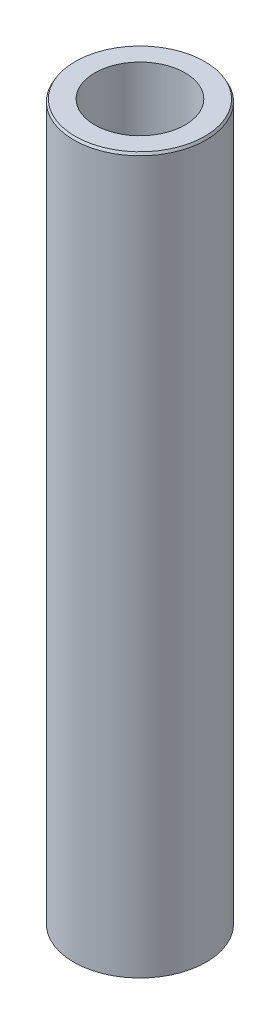
ISO-10303-21;
HEADER;
FILE_DESCRIPTION(('STEP AP214'),'2;1');
FILE_NAME('part.step','',(''),(''),'','','');
FILE_SCHEMA(('AUTOMOTIVE_DESIGN { 1 0 10303 214 1 1 1 1 }'));
ENDSEC;
DATA;
#1=APPLICATION_CONTEXT('core data for automotive mechanical design processes');
#2=APPLICATION_PROTOCOL_DEFINITION('international standard','automotive_design',2000,#1);
#3=PRODUCT_CONTEXT('',#1,'mechanical');
#4=PRODUCT('Part','Part','',(#3));
#5=PRODUCT_RELATED_PRODUCT_CATEGORY('part','',(#4));
#6=PRODUCT_DEFINITION_FORMATION('','',#4);
#7=PRODUCT_DEFINITION_CONTEXT('part definition',#1,'design');
#8=PRODUCT_DEFINITION('design','',#6,#7);
#9=PRODUCT_DEFINITION_SHAPE('','',#8);
#10=(LENGTH_UNIT() NAMED_UNIT(*) SI_UNIT(.MILLI.,.METRE.));
#11=(NAMED_UNIT(*) PLANE_ANGLE_UNIT() SI_UNIT($,.RADIAN.));
#12=(NAMED_UNIT(*) SI_UNIT($,.STERADIAN.) SOLID_ANGLE_UNIT());
#13=UNCERTAINTY_MEASURE_WITH_UNIT(LENGTH_MEASURE(1.E-05),#10,'distance_accuracy_value','');
#14=(GEOMETRIC_REPRESENTATION_CONTEXT(3) GLOBAL_UNCERTAINTY_ASSIGNED_CONTEXT((#13)) GLOBAL_UNIT_ASSIGNED_CONTEXT((#10,
#11,#12)) REPRESENTATION_CONTEXT('',''));
#15=CARTESIAN_POINT('',(0.,0.,0.));
#16=DIRECTION('',(0.,0.,1.));
#17=DIRECTION('',(1.,0.,0.));
#18=AXIS2_PLACEMENT_3D('',#15,#16,#17);
#19=CARTESIAN_POINT('',(0.,108.112324117727,0.));
#20=DIRECTION('',(0.,-1.,0.));
#21=DIRECTION('',(0.,0.,-1.));
#22=AXIS2_PLACEMENT_3D('',#19,#20,#21);
#23=CYLINDRICAL_SURFACE('',#22,10.);
#24=CARTESIAN_POINT('',(0.,107.741814341056,0.));
#25=DIRECTION('',(0.,1.,0.));
#26=DIRECTION('',(0.,0.,1.));
#27=AXIS2_PLACEMENT_3D('',#24,#25,#26);
#28=CIRCLE('',#27,10.);
#29=CARTESIAN_POINT('',(0.,107.741814341056,10.));
#30=VERTEX_POINT('',#29);
#31=EDGE_CURVE('E50',#30,#30,#28,.F.);
#32=ORIENTED_EDGE('',*,*,#31,.T.);
#33=EDGE_LOOP('',(#32));
#34=FACE_BOUND('',#33,.T.);
#35=CARTESIAN_POINT('',(0.,0.213913919298134,0.));
#36=DIRECTION('',(0.,1.,0.));
#37=DIRECTION('',(0.,0.,1.));
#38=AXIS2_PLACEMENT_3D('',#35,#36,#37);
#39=CIRCLE('',#38,10.);
#40=CARTESIAN_POINT('',(0.,0.213913919298134,10.));
#41=VERTEX_POINT('',#40);
#42=EDGE_CURVE('E51',#41,#41,#39,.T.);
#43=ORIENTED_EDGE('',*,*,#42,.T.);
#44=EDGE_LOOP('',(#43));
#45=FACE_BOUND('',#44,.T.);
#46=ADVANCED_FACE('F39',(#34,#45),#23,.T.);
#47=CARTESIAN_POINT('',(0.,108.112324117727,0.));
#48=DIRECTION('',(0.,1.,0.));
#49=DIRECTION('',(0.,0.,1.));
#50=AXIS2_PLACEMENT_3D('',#47,#48,#49);
#51=PLANE('',#50);
#52=CARTESIAN_POINT('',(0.,108.112324117727,0.));
#53=DIRECTION('',(0.,1.,0.));
#54=DIRECTION('',(0.,0.,1.));
#55=AXIS2_PLACEMENT_3D('',#52,#53,#54);
#56=CIRCLE('',#55,9.78608608070186);
#57=CARTESIAN_POINT('',(0.,108.112324117727,9.78608608070186));
#58=VERTEX_POINT('',#57);
#59=EDGE_CURVE('E54',#58,#58,#56,.T.);
#60=ORIENTED_EDGE('',*,*,#59,.T.);
#61=EDGE_LOOP('',(#60));
#62=FACE_BOUND('',#61,.T.);
#63=CARTESIAN_POINT('',(0.,108.112324117727,0.));
#64=DIRECTION('',(0.,1.,0.));
#65=DIRECTION('',(0.,0.,1.));
#66=AXIS2_PLACEMENT_3D('',#63,#64,#65);
#67=CIRCLE('',#66,6.82190587896266);
#68=CARTESIAN_POINT('',(0.,108.112324117727,6.82190587896266));
#69=VERTEX_POINT('',#68);
#70=EDGE_CURVE('E58',#69,#69,#67,.T.);
#71=ORIENTED_EDGE('',*,*,#70,.F.);
#72=EDGE_LOOP('',(#71));
#73=FACE_BOUND('',#72,.T.);
#74=ADVANCED_FACE('F69',(#62,#73),#51,.T.);
#75=CARTESIAN_POINT('',(0.,0.,0.));
#76=DIRECTION('',(0.,1.,0.));
#77=DIRECTION('',(0.,0.,1.));
#78=AXIS2_PLACEMENT_3D('',#75,#76,#77);
#79=PLANE('',#78);
#80=CARTESIAN_POINT('',(0.,0.,0.));
#81=DIRECTION('',(0.,1.,0.));
#82=DIRECTION('',(0.,0.,1.));
#83=AXIS2_PLACEMENT_3D('',#80,#81,#82);
#84=CIRCLE('',#83,9.62949022332946);
#85=CARTESIAN_POINT('',(0.,0.,9.62949022332946));
#86=VERTEX_POINT('',#85);
#87=EDGE_CURVE('E10',#86,#86,#84,.F.);
#88=ORIENTED_EDGE('',*,*,#87,.T.);
#89=EDGE_LOOP('',(#88));
#90=FACE_BOUND('',#89,.T.);
#91=CARTESIAN_POINT('',(0.,0.,0.));
#92=DIRECTION('',(0.,1.,0.));
#93=DIRECTION('',(0.,0.,1.));
#94=AXIS2_PLACEMENT_3D('',#91,#92,#93);
#95=CIRCLE('',#94,6.82190587896266);
#96=CARTESIAN_POINT('',(0.,0.,6.82190587896266));
#97=VERTEX_POINT('',#96);
#98=EDGE_CURVE('E63',#97,#97,#95,.T.);
#99=ORIENTED_EDGE('',*,*,#98,.T.);
#100=EDGE_LOOP('',(#99));
#101=FACE_BOUND('',#100,.T.);
#102=ADVANCED_FACE('F75',(#90,#101),#79,.F.);
#103=CARTESIAN_POINT('',(0.,108.112324117727,0.));
#104=DIRECTION('',(0.,-1.,0.));
#105=DIRECTION('',(0.,0.,-1.));
#106=AXIS2_PLACEMENT_3D('',#103,#104,#105);
#107=CYLINDRICAL_SURFACE('',#106,6.82190587896266);
#108=ORIENTED_EDGE('',*,*,#70,.T.);
#109=EDGE_LOOP('',(#108));
#110=FACE_BOUND('',#109,.T.);
#111=ORIENTED_EDGE('',*,*,#98,.F.);
#112=EDGE_LOOP('',(#111));
#113=FACE_BOUND('',#112,.T.);
#114=ADVANCED_FACE('F70',(#110,#113),#107,.F.);
#115=CARTESIAN_POINT('',(0.,108.112324117727,0.));
#116=DIRECTION('',(0.,-1.,0.));
#117=DIRECTION('',(0.,0.,-1.));
#118=AXIS2_PLACEMENT_3D('',#115,#116,#117);
#119=CONICAL_SURFACE('',#118,9.78608608070186,0.523598775598296);
#120=ORIENTED_EDGE('',*,*,#31,.F.);
#121=EDGE_LOOP('',(#120));
#122=FACE_BOUND('',#121,.T.);
#123=ORIENTED_EDGE('',*,*,#59,.F.);
#124=EDGE_LOOP('',(#123));
#125=FACE_BOUND('',#124,.T.);
#126=ADVANCED_FACE('F81',(#122,#125),#119,.T.);
#127=CARTESIAN_POINT('',(0.,0.213913919298134,0.));
#128=DIRECTION('',(0.,1.,0.));
#129=DIRECTION('',(0.,0.,1.));
#130=AXIS2_PLACEMENT_3D('',#127,#128,#129);
#131=CONICAL_SURFACE('',#130,10.,1.04719755119658);
#132=CARTESIAN_POINT('',(0.,0.,9.62949022332946));
#133=CARTESIAN_POINT('',(0.,0.00222826999268922,9.63334970016977));
#134=CARTESIAN_POINT('',(0.,0.004456539985378,9.63720917701009));
#135=CARTESIAN_POINT('',(0.,0.00891307997075556,9.64492813069073));
#136=CARTESIAN_POINT('',(0.,0.0111413499634443,9.64878760753105));
#137=CARTESIAN_POINT('',(0.,0.0155978899488221,9.65650656121168));
#138=CARTESIAN_POINT('',(0.,0.017826159941511,9.660366038052));
#139=CARTESIAN_POINT('',(0.,0.022282699926889,9.66808499173264));
#140=CARTESIAN_POINT('',(0.,0.024510969919578,9.67194446857296));
#141=CARTESIAN_POINT('',(0.,0.0289675099049557,9.67966342225359));
#142=CARTESIAN_POINT('',(0.,0.0311957798976444,9.68352289909391));
#143=CARTESIAN_POINT('',(0.,0.0356523198830221,9.69124185277455));
#144=CARTESIAN_POINT('',(0.,0.0378805898757111,9.69510132961487));
#145=CARTESIAN_POINT('',(0.,0.042337129861089,9.7028202832955));
#146=CARTESIAN_POINT('',(0.,0.044565399853778,9.70667976013582));
#147=CARTESIAN_POINT('',(0.,0.0490219398391557,9.71439871381646));
#148=CARTESIAN_POINT('',(0.,0.0512502098318444,9.71825819065677));
#149=CARTESIAN_POINT('',(0.,0.0557067498172221,9.72597714433741));
#150=CARTESIAN_POINT('',(0.,0.0579350198099111,9.72983662117773));
#151=CARTESIAN_POINT('',(0.,0.0623915597952891,9.73755557485836));
#152=CARTESIAN_POINT('',(0.,0.064619829787978,9.74141505169868));
#153=CARTESIAN_POINT('',(0.,0.0690763697733558,9.74913400537932));
#154=CARTESIAN_POINT('',(0.,0.0713046397660445,9.75299348221964));
#155=CARTESIAN_POINT('',(0.,0.0757611797514222,9.76071243590027));
#156=CARTESIAN_POINT('',(0.,0.0779894497441112,9.76457191274059));
#157=CARTESIAN_POINT('',(0.,0.0824459897294891,9.77229086642123));
#158=CARTESIAN_POINT('',(0.,0.0846742597221781,9.77615034326155));
#159=CARTESIAN_POINT('',(0.,0.0891307997075558,9.78386929694218));
#160=CARTESIAN_POINT('',(0.,0.0913590697002445,9.7877287737825));
#161=CARTESIAN_POINT('',(0.,0.0958156096856222,9.79544772746314));
#162=CARTESIAN_POINT('',(0.,0.0980438796783112,9.79930720430346));
#163=CARTESIAN_POINT('',(0.,0.102500419663689,9.80702615798409));
#164=CARTESIAN_POINT('',(0.,0.104728689656378,9.81088563482441));
#165=CARTESIAN_POINT('',(0.,0.109185229641756,9.81860458850505));
#166=CARTESIAN_POINT('',(0.,0.111413499634444,9.82246406534536));
#167=CARTESIAN_POINT('',(0.,0.115870039619822,9.830183019026));
#168=CARTESIAN_POINT('',(0.,0.118098309612511,9.83404249586632));
#169=CARTESIAN_POINT('',(0.,0.122554849597889,9.84176144954696));
#170=CARTESIAN_POINT('',(0.,0.124783119590578,9.84562092638727));
#171=CARTESIAN_POINT('',(0.,0.129239659575956,9.85333988006791));
#172=CARTESIAN_POINT('',(0.,0.131467929568645,9.85719935690823));
#173=CARTESIAN_POINT('',(0.,0.135924469554023,9.86491831058886));
#174=CARTESIAN_POINT('',(0.,0.138152739546712,9.86877778742918));
#175=CARTESIAN_POINT('',(0.,0.142609279532089,9.87649674110982));
#176=CARTESIAN_POINT('',(0.,0.144837549524778,9.88035621795014));
#177=CARTESIAN_POINT('',(0.,0.149294089510156,9.88807517163077));
#178=CARTESIAN_POINT('',(0.,0.151522359502845,9.89193464847109));
#179=CARTESIAN_POINT('',(0.,0.155978899488223,9.89965360215173));
#180=CARTESIAN_POINT('',(0.,0.158207169480912,9.90351307899205));
#181=CARTESIAN_POINT('',(0.,0.162663709466289,9.91123203267268));
#182=CARTESIAN_POINT('',(0.,0.164891979458978,9.915091509513));
#183=CARTESIAN_POINT('',(0.,0.169348519444356,9.92281046319364));
#184=CARTESIAN_POINT('',(0.,0.171576789437045,9.92666994003396));
#185=CARTESIAN_POINT('',(0.,0.176033329422423,9.93438889371459));
#186=CARTESIAN_POINT('',(0.,0.178261599415112,9.93824837055491));
#187=CARTESIAN_POINT('',(0.,0.182718139400489,9.94596732423555));
#188=CARTESIAN_POINT('',(0.,0.184946409393178,9.94982680107586));
#189=CARTESIAN_POINT('',(0.,0.189402949378556,9.9575457547565));
#190=CARTESIAN_POINT('',(0.,0.191631219371245,9.96140523159682));
#191=CARTESIAN_POINT('',(0.,0.196087759356623,9.96912418527745));
#192=CARTESIAN_POINT('',(0.,0.198316029349312,9.97298366211777));
#193=CARTESIAN_POINT('',(0.,0.202772569334689,9.98070261579841));
#194=CARTESIAN_POINT('',(0.,0.205000839327378,9.98456209263873));
#195=CARTESIAN_POINT('',(0.,0.209457379312756,9.99228104631936));
#196=CARTESIAN_POINT('',(0.,0.211685649305444,9.99614052315968));
#197=CARTESIAN_POINT('',(0.,0.213913919298134,10.));
#198=B_SPLINE_CURVE_WITH_KNOTS('',3,(#132,#133,#134,#135,#136,#137,#138,#139,#140,#141,#142,
#143,#144,#145,#146,#147,#148,#149,#150,#151,#152,#153,#154,#155,#156,#157,#158,#159,#160,#161,
#162,#163,#164,#165,#166,#167,#168,#169,#170,#171,#172,#173,#174,#175,#176,#177,#178,#179,#180,
#181,#182,#183,#184,#185,#186,#187,#188,#189,#190,#191,#192,#193,#194,#195,#196,#197),
.UNSPECIFIED.,.F.,.F.,(4,2,2,2,2,2,2,2,2,2,2,2,2,2,2,2,2,2,2,2,2,2,2,2,2,2,2,2,2,2,2,2,4),(0.,
0.0133696199561325,0.0267392399122665,0.040108859868399,0.0534784798245315,0.0668480997806655,
0.080217719736798,0.0935873396929305,0.106956959649065,0.120326579605197,0.13369619956133,
0.147065819517464,0.160435439473596,0.173805059429729,0.187174679385863,0.200544299341995,
0.213913919298128,0.227283539254262,0.240653159210394,0.254022779166528,0.267392399122661,
0.280762019078793,0.294131639034927,0.30750125899106,0.320870878947192,0.334240498903326,
0.347610118859459,0.360979738815591,0.374349358771725,0.387718978727858,0.40108859868399,
0.414458218640124,0.427827838596257),.UNSPECIFIED.);
#199=EDGE_CURVE('BSEAM45',#86,#41,#198,.T.);
#200=ORIENTED_EDGE('',*,*,#87,.F.);
#201=ORIENTED_EDGE('',*,*,#42,.F.);
#202=ORIENTED_EDGE('',*,*,#199,.T.);
#203=ORIENTED_EDGE('',*,*,#199,.F.);
#204=EDGE_LOOP('',(#200,#202,#201,#203));
#205=FACE_BOUND('',#204,.T.);
#206=ADVANCED_FACE('F45',(#205),#131,.T.);
#207=CLOSED_SHELL('',(#46,#74,#102,#114,#126,#206));
#208=MANIFOLD_SOLID_BREP('B2',#207);
#209=ADVANCED_BREP_SHAPE_REPRESENTATION('',(#18,#208),#14);
#210=SHAPE_DEFINITION_REPRESENTATION(#9,#209);
ENDSEC;
END-ISO-10303-21;
